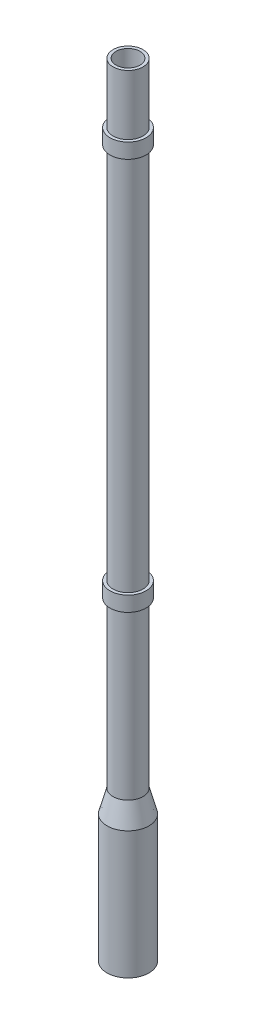
ISO-10303-21;
HEADER;
FILE_DESCRIPTION(('STEP AP214'),'2;1');
FILE_NAME('part.step','',(''),(''),'','','');
FILE_SCHEMA(('AUTOMOTIVE_DESIGN { 1 0 10303 214 1 1 1 1 }'));
ENDSEC;
DATA;
#1=APPLICATION_CONTEXT('core data for automotive mechanical design processes');
#2=APPLICATION_PROTOCOL_DEFINITION('international standard','automotive_design',2000,#1);
#3=PRODUCT_CONTEXT('',#1,'mechanical');
#4=PRODUCT('Part','Part','',(#3));
#5=PRODUCT_RELATED_PRODUCT_CATEGORY('part','',(#4));
#6=PRODUCT_DEFINITION_FORMATION('','',#4);
#7=PRODUCT_DEFINITION_CONTEXT('part definition',#1,'design');
#8=PRODUCT_DEFINITION('design','',#6,#7);
#9=PRODUCT_DEFINITION_SHAPE('','',#8);
#10=(LENGTH_UNIT() NAMED_UNIT(*) SI_UNIT(.MILLI.,.METRE.));
#11=(NAMED_UNIT(*) PLANE_ANGLE_UNIT() SI_UNIT($,.RADIAN.));
#12=(NAMED_UNIT(*) SI_UNIT($,.STERADIAN.) SOLID_ANGLE_UNIT());
#13=UNCERTAINTY_MEASURE_WITH_UNIT(LENGTH_MEASURE(1.E-05),#10,'distance_accuracy_value','');
#14=(GEOMETRIC_REPRESENTATION_CONTEXT(3) GLOBAL_UNCERTAINTY_ASSIGNED_CONTEXT((#13)) GLOBAL_UNIT_ASSIGNED_CONTEXT((#10,
#11,#12)) REPRESENTATION_CONTEXT('',''));
#15=CARTESIAN_POINT('',(0.,0.,0.));
#16=DIRECTION('',(0.,0.,1.));
#17=DIRECTION('',(1.,0.,0.));
#18=AXIS2_PLACEMENT_3D('',#15,#16,#17);
#19=CARTESIAN_POINT('',(0.,0.,0.));
#20=DIRECTION('',(0.,-1.,0.));
#21=DIRECTION('',(1.,0.,0.));
#22=AXIS2_PLACEMENT_3D('',#19,#20,#21);
#23=CYLINDRICAL_SURFACE('',#22,50.);
#24=CARTESIAN_POINT('',(0.,0.,0.));
#25=DIRECTION('',(0.,-1.,0.));
#26=DIRECTION('',(1.,0.,0.));
#27=AXIS2_PLACEMENT_3D('',#24,#25,#26);
#28=CIRCLE('',#27,50.);
#29=CARTESIAN_POINT('',(50.,0.,0.));
#30=VERTEX_POINT('',#29);
#31=EDGE_CURVE('E92',#30,#30,#28,.T.);
#32=ORIENTED_EDGE('',*,*,#31,.F.);
#33=EDGE_LOOP('',(#32));
#34=FACE_BOUND('',#33,.T.);
#35=CARTESIAN_POINT('',(0.,550.,0.));
#36=DIRECTION('',(0.,1.,0.));
#37=DIRECTION('',(-1.,0.,0.));
#38=AXIS2_PLACEMENT_3D('',#35,#36,#37);
#39=CIRCLE('',#38,50.);
#40=CARTESIAN_POINT('',(-50.,550.,0.));
#41=VERTEX_POINT('',#40);
#42=EDGE_CURVE('E12',#41,#41,#39,.T.);
#43=ORIENTED_EDGE('',*,*,#42,.F.);
#44=EDGE_LOOP('',(#43));
#45=FACE_BOUND('',#44,.T.);
#46=ADVANCED_FACE('F48',(#34,#45),#23,.T.);
#47=CARTESIAN_POINT('',(0.,600.,0.));
#48=DIRECTION('',(0.,1.,0.));
#49=DIRECTION('',(-1.,0.,0.));
#50=AXIS2_PLACEMENT_3D('',#47,#48,#49);
#51=CIRCLE('',#50,50.);
#52=CARTESIAN_POINT('',(-50.,600.,0.));
#53=VERTEX_POINT('',#52);
#54=EDGE_CURVE('E64',#53,#53,#51,.T.);
#55=ORIENTED_EDGE('',*,*,#54,.T.);
#56=EDGE_LOOP('',(#55));
#57=FACE_BOUND('',#56,.T.);
#58=CARTESIAN_POINT('',(0.,1860.,0.));
#59=DIRECTION('',(0.,1.,0.));
#60=DIRECTION('',(-1.,0.,0.));
#61=AXIS2_PLACEMENT_3D('',#58,#59,#60);
#62=CIRCLE('',#61,50.);
#63=CARTESIAN_POINT('',(-50.,1860.,0.));
#64=VERTEX_POINT('',#63);
#65=EDGE_CURVE('E56',#64,#64,#62,.T.);
#66=ORIENTED_EDGE('',*,*,#65,.F.);
#67=EDGE_LOOP('',(#66));
#68=FACE_BOUND('',#67,.T.);
#69=ADVANCED_FACE('F103',(#57,#68),#23,.T.);
#70=CARTESIAN_POINT('',(-50.,2110.,0.));
#71=DIRECTION('',(0.,-1.,0.));
#72=DIRECTION('',(1.,0.,0.));
#73=AXIS2_PLACEMENT_3D('',#70,#71,#72);
#74=PLANE('',#73);
#75=CARTESIAN_POINT('',(0.,2110.,0.));
#76=DIRECTION('',(0.,-1.,0.));
#77=DIRECTION('',(1.,0.,0.));
#78=AXIS2_PLACEMENT_3D('',#75,#76,#77);
#79=CIRCLE('',#78,50.);
#80=CARTESIAN_POINT('',(50.,2110.,0.));
#81=VERTEX_POINT('',#80);
#82=EDGE_CURVE('E52',#81,#81,#79,.T.);
#83=ORIENTED_EDGE('',*,*,#82,.F.);
#84=EDGE_LOOP('',(#83));
#85=FACE_BOUND('',#84,.T.);
#86=CARTESIAN_POINT('',(0.,2110.,0.));
#87=DIRECTION('',(0.,-1.,0.));
#88=DIRECTION('',(1.,0.,0.));
#89=AXIS2_PLACEMENT_3D('',#86,#87,#88);
#90=CIRCLE('',#89,40.);
#91=CARTESIAN_POINT('',(40.,2110.,0.));
#92=VERTEX_POINT('',#91);
#93=EDGE_CURVE('E75',#92,#92,#90,.T.);
#94=ORIENTED_EDGE('',*,*,#93,.T.);
#95=EDGE_LOOP('',(#94));
#96=FACE_BOUND('',#95,.T.);
#97=ADVANCED_FACE('F50',(#85,#96),#74,.F.);
#98=CARTESIAN_POINT('',(0.,1910.,0.));
#99=DIRECTION('',(0.,1.,0.));
#100=DIRECTION('',(-1.,0.,0.));
#101=AXIS2_PLACEMENT_3D('',#98,#99,#100);
#102=CIRCLE('',#101,50.);
#103=CARTESIAN_POINT('',(-50.,1910.,0.));
#104=VERTEX_POINT('',#103);
#105=EDGE_CURVE('E69',#104,#104,#102,.T.);
#106=ORIENTED_EDGE('',*,*,#105,.T.);
#107=EDGE_LOOP('',(#106));
#108=FACE_BOUND('',#107,.T.);
#109=ORIENTED_EDGE('',*,*,#82,.T.);
#110=EDGE_LOOP('',(#109));
#111=FACE_BOUND('',#110,.T.);
#112=ADVANCED_FACE('F99',(#108,#111),#23,.T.);
#113=CARTESIAN_POINT('',(0.,0.,0.));
#114=DIRECTION('',(0.,-1.,0.));
#115=DIRECTION('',(1.,0.,0.));
#116=AXIS2_PLACEMENT_3D('',#113,#114,#115);
#117=CONICAL_SURFACE('',#116,50.,0.26179938779915);
#118=CARTESIAN_POINT('',(0.,-74.6410161513774,0.));
#119=DIRECTION('',(0.,-1.,0.));
#120=DIRECTION('',(1.,0.,0.));
#121=AXIS2_PLACEMENT_3D('',#118,#119,#120);
#122=CIRCLE('',#121,70.);
#123=CARTESIAN_POINT('',(70.,-74.6410161513774,0.));
#124=VERTEX_POINT('',#123);
#125=EDGE_CURVE('E90',#124,#124,#122,.T.);
#126=ORIENTED_EDGE('',*,*,#125,.F.);
#127=EDGE_LOOP('',(#126));
#128=FACE_BOUND('',#127,.T.);
#129=ORIENTED_EDGE('',*,*,#31,.T.);
#130=EDGE_LOOP('',(#129));
#131=FACE_BOUND('',#130,.T.);
#132=ADVANCED_FACE('F134',(#128,#131),#117,.T.);
#133=CARTESIAN_POINT('',(0.,0.,0.));
#134=DIRECTION('',(0.,-1.,0.));
#135=DIRECTION('',(1.,0.,0.));
#136=AXIS2_PLACEMENT_3D('',#133,#134,#135);
#137=CYLINDRICAL_SURFACE('',#136,70.);
#138=CARTESIAN_POINT('',(0.,-500.,0.));
#139=DIRECTION('',(0.,-1.,0.));
#140=DIRECTION('',(1.,0.,0.));
#141=AXIS2_PLACEMENT_3D('',#138,#139,#140);
#142=CIRCLE('',#141,70.);
#143=CARTESIAN_POINT('',(70.,-500.,0.));
#144=VERTEX_POINT('',#143);
#145=EDGE_CURVE('E87',#144,#144,#142,.T.);
#146=ORIENTED_EDGE('',*,*,#145,.F.);
#147=EDGE_LOOP('',(#146));
#148=FACE_BOUND('',#147,.T.);
#149=ORIENTED_EDGE('',*,*,#125,.T.);
#150=EDGE_LOOP('',(#149));
#151=FACE_BOUND('',#150,.T.);
#152=ADVANCED_FACE('F128',(#148,#151),#137,.T.);
#153=CARTESIAN_POINT('',(-70.,-500.,0.));
#154=DIRECTION('',(0.,1.,0.));
#155=DIRECTION('',(-1.,0.,0.));
#156=AXIS2_PLACEMENT_3D('',#153,#154,#155);
#157=PLANE('',#156);
#158=CARTESIAN_POINT('',(0.,-500.,0.));
#159=DIRECTION('',(0.,-1.,0.));
#160=DIRECTION('',(1.,0.,0.));
#161=AXIS2_PLACEMENT_3D('',#158,#159,#160);
#162=CIRCLE('',#161,60.);
#163=CARTESIAN_POINT('',(60.,-500.,0.));
#164=VERTEX_POINT('',#163);
#165=EDGE_CURVE('E84',#164,#164,#162,.T.);
#166=ORIENTED_EDGE('',*,*,#165,.F.);
#167=EDGE_LOOP('',(#166));
#168=FACE_BOUND('',#167,.T.);
#169=ORIENTED_EDGE('',*,*,#145,.T.);
#170=EDGE_LOOP('',(#169));
#171=FACE_BOUND('',#170,.T.);
#172=ADVANCED_FACE('F122',(#168,#171),#157,.F.);
#173=CARTESIAN_POINT('',(0.,0.,0.));
#174=DIRECTION('',(0.,-1.,0.));
#175=DIRECTION('',(1.,0.,0.));
#176=AXIS2_PLACEMENT_3D('',#173,#174,#175);
#177=CYLINDRICAL_SURFACE('',#176,60.);
#178=CARTESIAN_POINT('',(0.,-75.9575411272513,0.));
#179=DIRECTION('',(0.,-1.,0.));
#180=DIRECTION('',(1.,0.,0.));
#181=AXIS2_PLACEMENT_3D('',#178,#179,#180);
#182=CIRCLE('',#181,60.);
#183=CARTESIAN_POINT('',(60.,-75.9575411272513,0.));
#184=VERTEX_POINT('',#183);
#185=EDGE_CURVE('E81',#184,#184,#182,.T.);
#186=ORIENTED_EDGE('',*,*,#185,.F.);
#187=EDGE_LOOP('',(#186));
#188=FACE_BOUND('',#187,.T.);
#189=ORIENTED_EDGE('',*,*,#165,.T.);
#190=EDGE_LOOP('',(#189));
#191=FACE_BOUND('',#190,.T.);
#192=ADVANCED_FACE('F116',(#188,#191),#177,.F.);
#193=CARTESIAN_POINT('',(0.,-75.9575411272513,0.));
#194=DIRECTION('',(0.,-1.,0.));
#195=DIRECTION('',(1.,0.,0.));
#196=AXIS2_PLACEMENT_3D('',#193,#194,#195);
#197=CONICAL_SURFACE('',#196,60.,0.26179938779915);
#198=CARTESIAN_POINT('',(0.,-1.31652497587398,0.));
#199=DIRECTION('',(0.,-1.,0.));
#200=DIRECTION('',(1.,0.,0.));
#201=AXIS2_PLACEMENT_3D('',#198,#199,#200);
#202=CIRCLE('',#201,40.);
#203=CARTESIAN_POINT('',(40.,-1.31652497587398,0.));
#204=VERTEX_POINT('',#203);
#205=EDGE_CURVE('E78',#204,#204,#202,.T.);
#206=ORIENTED_EDGE('',*,*,#205,.F.);
#207=EDGE_LOOP('',(#206));
#208=FACE_BOUND('',#207,.T.);
#209=ORIENTED_EDGE('',*,*,#185,.T.);
#210=EDGE_LOOP('',(#209));
#211=FACE_BOUND('',#210,.T.);
#212=ADVANCED_FACE('F110',(#208,#211),#197,.F.);
#213=CARTESIAN_POINT('',(0.,0.,0.));
#214=DIRECTION('',(0.,-1.,0.));
#215=DIRECTION('',(1.,0.,0.));
#216=AXIS2_PLACEMENT_3D('',#213,#214,#215);
#217=CYLINDRICAL_SURFACE('',#216,40.);
#218=ORIENTED_EDGE('',*,*,#93,.F.);
#219=EDGE_LOOP('',(#218));
#220=FACE_BOUND('',#219,.T.);
#221=ORIENTED_EDGE('',*,*,#205,.T.);
#222=EDGE_LOOP('',(#221));
#223=FACE_BOUND('',#222,.T.);
#224=ADVANCED_FACE('F106',(#220,#223),#217,.F.);
#225=CARTESIAN_POINT('',(0.,1910.,0.));
#226=DIRECTION('',(0.,1.,0.));
#227=DIRECTION('',(-1.,0.,0.));
#228=AXIS2_PLACEMENT_3D('',#225,#226,#227);
#229=PLANE('',#228);
#230=CARTESIAN_POINT('',(0.,1910.,0.));
#231=DIRECTION('',(0.,1.,0.));
#232=DIRECTION('',(-1.,0.,0.));
#233=AXIS2_PLACEMENT_3D('',#230,#231,#232);
#234=CIRCLE('',#233,60.);
#235=CARTESIAN_POINT('',(-60.,1910.,0.));
#236=VERTEX_POINT('',#235);
#237=EDGE_CURVE('E66',#236,#236,#234,.T.);
#238=ORIENTED_EDGE('',*,*,#237,.T.);
#239=EDGE_LOOP('',(#238));
#240=FACE_BOUND('',#239,.T.);
#241=ORIENTED_EDGE('',*,*,#105,.F.);
#242=EDGE_LOOP('',(#241));
#243=FACE_BOUND('',#242,.T.);
#244=ADVANCED_FACE('F109',(#240,#243),#229,.T.);
#245=CARTESIAN_POINT('',(0.,1860.,0.));
#246=DIRECTION('',(0.,1.,0.));
#247=DIRECTION('',(-1.,0.,0.));
#248=AXIS2_PLACEMENT_3D('',#245,#246,#247);
#249=PLANE('',#248);
#250=CARTESIAN_POINT('',(0.,1860.,0.));
#251=DIRECTION('',(0.,1.,0.));
#252=DIRECTION('',(-1.,0.,0.));
#253=AXIS2_PLACEMENT_3D('',#250,#251,#252);
#254=CIRCLE('',#253,60.);
#255=CARTESIAN_POINT('',(-60.,1860.,0.));
#256=VERTEX_POINT('',#255);
#257=EDGE_CURVE('E70',#256,#256,#254,.T.);
#258=ORIENTED_EDGE('',*,*,#257,.F.);
#259=EDGE_LOOP('',(#258));
#260=FACE_BOUND('',#259,.T.);
#261=ORIENTED_EDGE('',*,*,#65,.T.);
#262=EDGE_LOOP('',(#261));
#263=FACE_BOUND('',#262,.T.);
#264=ADVANCED_FACE('F158',(#260,#263),#249,.F.);
#265=CARTESIAN_POINT('',(0.,1910.,0.));
#266=DIRECTION('',(0.,-1.,0.));
#267=DIRECTION('',(1.,0.,0.));
#268=AXIS2_PLACEMENT_3D('',#265,#266,#267);
#269=CYLINDRICAL_SURFACE('',#268,60.);
#270=ORIENTED_EDGE('',*,*,#237,.F.);
#271=EDGE_LOOP('',(#270));
#272=FACE_BOUND('',#271,.T.);
#273=ORIENTED_EDGE('',*,*,#257,.T.);
#274=EDGE_LOOP('',(#273));
#275=FACE_BOUND('',#274,.T.);
#276=ADVANCED_FACE('F160',(#272,#275),#269,.T.);
#277=CARTESIAN_POINT('',(0.,550.,0.));
#278=DIRECTION('',(0.,1.,0.));
#279=DIRECTION('',(-1.,0.,0.));
#280=AXIS2_PLACEMENT_3D('',#277,#278,#279);
#281=PLANE('',#280);
#282=CARTESIAN_POINT('',(0.,550.,0.));
#283=DIRECTION('',(0.,1.,0.));
#284=DIRECTION('',(-1.,0.,0.));
#285=AXIS2_PLACEMENT_3D('',#282,#283,#284);
#286=CIRCLE('',#285,60.);
#287=CARTESIAN_POINT('',(-60.,550.,0.));
#288=VERTEX_POINT('',#287);
#289=EDGE_CURVE('E188',#288,#288,#286,.T.);
#290=ORIENTED_EDGE('',*,*,#289,.F.);
#291=EDGE_LOOP('',(#290));
#292=FACE_BOUND('',#291,.T.);
#293=ORIENTED_EDGE('',*,*,#42,.T.);
#294=EDGE_LOOP('',(#293));
#295=FACE_BOUND('',#294,.T.);
#296=ADVANCED_FACE('F167',(#292,#295),#281,.F.);
#297=CARTESIAN_POINT('',(0.,600.,0.));
#298=DIRECTION('',(0.,1.,0.));
#299=DIRECTION('',(-1.,0.,0.));
#300=AXIS2_PLACEMENT_3D('',#297,#298,#299);
#301=PLANE('',#300);
#302=CARTESIAN_POINT('',(0.,600.,0.));
#303=DIRECTION('',(0.,1.,0.));
#304=DIRECTION('',(-1.,0.,0.));
#305=AXIS2_PLACEMENT_3D('',#302,#303,#304);
#306=CIRCLE('',#305,60.);
#307=CARTESIAN_POINT('',(-60.,600.,0.));
#308=VERTEX_POINT('',#307);
#309=EDGE_CURVE('E189',#308,#308,#306,.T.);
#310=ORIENTED_EDGE('',*,*,#309,.T.);
#311=EDGE_LOOP('',(#310));
#312=FACE_BOUND('',#311,.T.);
#313=ORIENTED_EDGE('',*,*,#54,.F.);
#314=EDGE_LOOP('',(#313));
#315=FACE_BOUND('',#314,.T.);
#316=ADVANCED_FACE('F177',(#312,#315),#301,.T.);
#317=CARTESIAN_POINT('',(0.,550.,0.));
#318=DIRECTION('',(0.,1.,0.));
#319=DIRECTION('',(-1.,0.,0.));
#320=AXIS2_PLACEMENT_3D('',#317,#318,#319);
#321=CYLINDRICAL_SURFACE('',#320,60.);
#322=ORIENTED_EDGE('',*,*,#289,.T.);
#323=EDGE_LOOP('',(#322));
#324=FACE_BOUND('',#323,.T.);
#325=ORIENTED_EDGE('',*,*,#309,.F.);
#326=EDGE_LOOP('',(#325));
#327=FACE_BOUND('',#326,.T.);
#328=ADVANCED_FACE('F174',(#324,#327),#321,.T.);
#329=CLOSED_SHELL('',(#46,#69,#97,#112,#132,#152,#172,#192,#212,#224,#244,#264,#276,#296,#316,#328));
#330=MANIFOLD_SOLID_BREP('B2',#329);
#331=ADVANCED_BREP_SHAPE_REPRESENTATION('',(#18,#330),#14);
#332=SHAPE_DEFINITION_REPRESENTATION(#9,#331);
ENDSEC;
END-ISO-10303-21;
